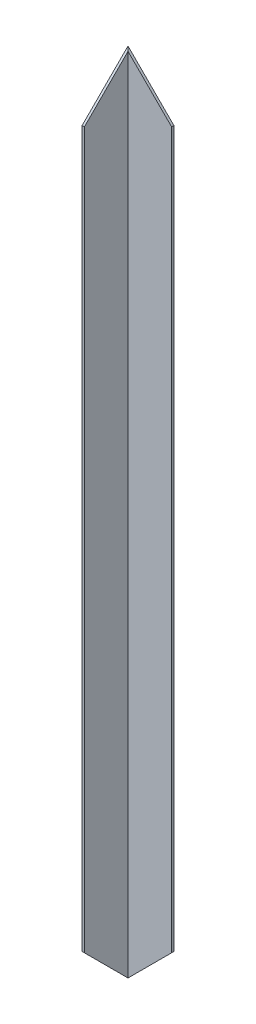
ISO-10303-21;
HEADER;
FILE_DESCRIPTION(('STEP AP214'),'2;1');
FILE_NAME('part.step','',(''),(''),'','','');
FILE_SCHEMA(('AUTOMOTIVE_DESIGN { 1 0 10303 214 1 1 1 1 }'));
ENDSEC;
DATA;
#1=APPLICATION_CONTEXT('core data for automotive mechanical design processes');
#2=APPLICATION_PROTOCOL_DEFINITION('international standard','automotive_design',2000,#1);
#3=PRODUCT_CONTEXT('',#1,'mechanical');
#4=PRODUCT('Part','Part','',(#3));
#5=PRODUCT_RELATED_PRODUCT_CATEGORY('part','',(#4));
#6=PRODUCT_DEFINITION_FORMATION('','',#4);
#7=PRODUCT_DEFINITION_CONTEXT('part definition',#1,'design');
#8=PRODUCT_DEFINITION('design','',#6,#7);
#9=PRODUCT_DEFINITION_SHAPE('','',#8);
#10=(LENGTH_UNIT() NAMED_UNIT(*) SI_UNIT(.MILLI.,.METRE.));
#11=(NAMED_UNIT(*) PLANE_ANGLE_UNIT() SI_UNIT($,.RADIAN.));
#12=(NAMED_UNIT(*) SI_UNIT($,.STERADIAN.) SOLID_ANGLE_UNIT());
#13=UNCERTAINTY_MEASURE_WITH_UNIT(LENGTH_MEASURE(1.E-05),#10,'distance_accuracy_value','');
#14=(GEOMETRIC_REPRESENTATION_CONTEXT(3) GLOBAL_UNCERTAINTY_ASSIGNED_CONTEXT((#13)) GLOBAL_UNIT_ASSIGNED_CONTEXT((#10,
#11,#12)) REPRESENTATION_CONTEXT('',''));
#15=CARTESIAN_POINT('',(0.,0.,0.));
#16=DIRECTION('',(0.,0.,1.));
#17=DIRECTION('',(1.,0.,0.));
#18=AXIS2_PLACEMENT_3D('',#15,#16,#17);
#19=CARTESIAN_POINT('',(-20.,704.,-20.1136363636364));
#20=DIRECTION('',(1.,0.,0.));
#21=DIRECTION('',(0.,0.,-1.));
#22=AXIS2_PLACEMENT_3D('',#19,#20,#21);
#23=PLANE('',#22);
#24=DIRECTION('',(0.,-1.,0.));
#25=VECTOR('',#24,1.);
#26=CARTESIAN_POINT('',(-20.,704.,19.8863636363636));
#27=LINE('',#26,#25);
#28=CARTESIAN_POINT('',(-20.,664.,19.8863636363636));
#29=VERTEX_POINT('',#28);
#30=CARTESIAN_POINT('',(-20.,39.9999999999996,19.8863636363636));
#31=VERTEX_POINT('',#30);
#32=EDGE_CURVE('E110',#29,#31,#27,.T.);
#33=ORIENTED_EDGE('',*,*,#32,.F.);
#34=DIRECTION('',(0.,-0.707106781186544,0.707106781186551));
#35=VECTOR('',#34,1.);
#36=CARTESIAN_POINT('',(-20.,704.,-20.1136363636364));
#37=LINE('',#36,#35);
#38=CARTESIAN_POINT('',(-20.,704.,-20.1136363636364));
#39=VERTEX_POINT('',#38);
#40=EDGE_CURVE('E128',#39,#29,#37,.T.);
#41=ORIENTED_EDGE('',*,*,#40,.F.);
#42=DIRECTION('',(0.,-1.,0.));
#43=VECTOR('',#42,1.);
#44=CARTESIAN_POINT('',(-20.,704.,-20.1136363636364));
#45=LINE('',#44,#43);
#46=CARTESIAN_POINT('',(-20.,0.,-20.1136363636364));
#47=VERTEX_POINT('',#46);
#48=EDGE_CURVE('E96',#39,#47,#45,.T.);
#49=ORIENTED_EDGE('',*,*,#48,.T.);
#50=DIRECTION('',(0.,-0.707106781186544,-0.707106781186551));
#51=VECTOR('',#50,1.);
#52=CARTESIAN_POINT('',(-20.,0.,-20.1136363636364));
#53=LINE('',#52,#51);
#54=EDGE_CURVE('E127',#31,#47,#53,.T.);
#55=ORIENTED_EDGE('',*,*,#54,.F.);
#56=EDGE_LOOP('',(#33,#41,#49,#55));
#57=FACE_BOUND('',#56,.T.);
#58=ADVANCED_FACE('F33',(#57),#23,.F.);
#59=CARTESIAN_POINT('',(-20.,704.,19.8863636363636));
#60=DIRECTION('',(0.,0.,-1.));
#61=DIRECTION('',(-1.,0.,0.));
#62=AXIS2_PLACEMENT_3D('',#59,#60,#61);
#63=PLANE('',#62);
#64=DIRECTION('',(0.,-1.,0.));
#65=VECTOR('',#64,1.);
#66=CARTESIAN_POINT('',(-18.,704.,19.8863636363636));
#67=LINE('',#66,#65);
#68=CARTESIAN_POINT('',(-18.,664.,19.8863636363636));
#69=VERTEX_POINT('',#68);
#70=CARTESIAN_POINT('',(-18.,39.9999999999996,19.8863636363636));
#71=VERTEX_POINT('',#70);
#72=EDGE_CURVE('E108',#69,#71,#67,.T.);
#73=ORIENTED_EDGE('',*,*,#72,.F.);
#74=DIRECTION('',(-1.,0.,0.));
#75=VECTOR('',#74,1.);
#76=CARTESIAN_POINT('',(20.,664.,19.8863636363636));
#77=LINE('',#76,#75);
#78=EDGE_CURVE('E131',#69,#29,#77,.T.);
#79=ORIENTED_EDGE('',*,*,#78,.T.);
#80=ORIENTED_EDGE('',*,*,#32,.T.);
#81=DIRECTION('',(-1.,0.,0.));
#82=VECTOR('',#81,1.);
#83=CARTESIAN_POINT('',(570.,39.9999999999996,19.8863636363635));
#84=LINE('',#83,#82);
#85=EDGE_CURVE('E140',#71,#31,#84,.T.);
#86=ORIENTED_EDGE('',*,*,#85,.F.);
#87=EDGE_LOOP('',(#73,#79,#80,#86));
#88=FACE_BOUND('',#87,.T.);
#89=ADVANCED_FACE('F154',(#88),#63,.F.);
#90=CARTESIAN_POINT('',(-18.,704.,-18.1136363636364));
#91=DIRECTION('',(-1.,0.,0.));
#92=DIRECTION('',(0.,0.,1.));
#93=AXIS2_PLACEMENT_3D('',#90,#91,#92);
#94=PLANE('',#93);
#95=DIRECTION('',(0.,-1.,0.));
#96=VECTOR('',#95,1.);
#97=CARTESIAN_POINT('',(-18.,704.,-18.1136363636364));
#98=LINE('',#97,#96);
#99=CARTESIAN_POINT('',(-18.,702.,-18.1136363636364));
#100=VERTEX_POINT('',#99);
#101=CARTESIAN_POINT('',(-18.,2.,-18.1136363636364));
#102=VERTEX_POINT('',#101);
#103=EDGE_CURVE('E101',#100,#102,#98,.T.);
#104=ORIENTED_EDGE('',*,*,#103,.F.);
#105=DIRECTION('',(0.,-0.707106781186544,0.707106781186551));
#106=VECTOR('',#105,1.);
#107=CARTESIAN_POINT('',(-18.,703.,-19.1136363636363));
#108=LINE('',#107,#106);
#109=EDGE_CURVE('E133',#100,#69,#108,.T.);
#110=ORIENTED_EDGE('',*,*,#109,.T.);
#111=ORIENTED_EDGE('',*,*,#72,.T.);
#112=DIRECTION('',(0.,-0.707106781186544,-0.707106781186551));
#113=VECTOR('',#112,1.);
#114=CARTESIAN_POINT('',(-18.,352.999999999996,332.886363636364));
#115=LINE('',#114,#113);
#116=EDGE_CURVE('E121',#71,#102,#115,.T.);
#117=ORIENTED_EDGE('',*,*,#116,.T.);
#118=EDGE_LOOP('',(#104,#110,#111,#117));
#119=FACE_BOUND('',#118,.T.);
#120=ADVANCED_FACE('F149',(#119),#94,.F.);
#121=CARTESIAN_POINT('',(-18.,704.,-18.1136363636364));
#122=DIRECTION('',(0.,0.,-1.));
#123=DIRECTION('',(-1.,0.,0.));
#124=AXIS2_PLACEMENT_3D('',#121,#122,#123);
#125=PLANE('',#124);
#126=DIRECTION('',(0.,-1.,0.));
#127=VECTOR('',#126,1.);
#128=CARTESIAN_POINT('',(20.,704.,-18.1136363636364));
#129=LINE('',#128,#127);
#130=CARTESIAN_POINT('',(20.,664.,-18.1136363636364));
#131=VERTEX_POINT('',#130);
#132=CARTESIAN_POINT('',(20.,40.0000000000001,-18.1136363636364));
#133=VERTEX_POINT('',#132);
#134=EDGE_CURVE('E47',#131,#133,#129,.T.);
#135=ORIENTED_EDGE('',*,*,#134,.F.);
#136=DIRECTION('',(-0.707106781186551,0.707106781186544,0.));
#137=VECTOR('',#136,1.);
#138=CARTESIAN_POINT('',(-19.,703.,-18.1136363636364));
#139=LINE('',#138,#137);
#140=EDGE_CURVE('E91',#131,#100,#139,.T.);
#141=ORIENTED_EDGE('',*,*,#140,.T.);
#142=ORIENTED_EDGE('',*,*,#103,.T.);
#143=DIRECTION('',(0.707106781186547,0.707106781186549,0.));
#144=VECTOR('',#143,1.);
#145=CARTESIAN_POINT('',(333.,353.000000000001,-18.1136363636364));
#146=LINE('',#145,#144);
#147=EDGE_CURVE('E103',#102,#133,#146,.T.);
#148=ORIENTED_EDGE('',*,*,#147,.T.);
#149=EDGE_LOOP('',(#135,#141,#142,#148));
#150=FACE_BOUND('',#149,.T.);
#151=ADVANCED_FACE('F145',(#150),#125,.F.);
#152=CARTESIAN_POINT('',(20.,704.,-20.1136363636364));
#153=DIRECTION('',(-1.,0.,0.));
#154=DIRECTION('',(0.,0.,1.));
#155=AXIS2_PLACEMENT_3D('',#152,#153,#154);
#156=PLANE('',#155);
#157=DIRECTION('',(0.,-1.,0.));
#158=VECTOR('',#157,1.);
#159=CARTESIAN_POINT('',(20.,704.,-20.1136363636364));
#160=LINE('',#159,#158);
#161=CARTESIAN_POINT('',(20.,664.,-20.1136363636364));
#162=VERTEX_POINT('',#161);
#163=CARTESIAN_POINT('',(20.,40.0000000000001,-20.1136363636364));
#164=VERTEX_POINT('',#163);
#165=EDGE_CURVE('E55',#162,#164,#160,.T.);
#166=ORIENTED_EDGE('',*,*,#165,.F.);
#167=DIRECTION('',(0.,0.,-1.));
#168=VECTOR('',#167,1.);
#169=CARTESIAN_POINT('',(20.,664.,19.8863636363636));
#170=LINE('',#169,#168);
#171=EDGE_CURVE('E87',#131,#162,#170,.T.);
#172=ORIENTED_EDGE('',*,*,#171,.F.);
#173=ORIENTED_EDGE('',*,*,#134,.T.);
#174=DIRECTION('',(0.,0.,-1.));
#175=VECTOR('',#174,1.);
#176=CARTESIAN_POINT('',(20.,40.0000000000001,569.886363636364));
#177=LINE('',#176,#175);
#178=EDGE_CURVE('E99',#133,#164,#177,.T.);
#179=ORIENTED_EDGE('',*,*,#178,.T.);
#180=EDGE_LOOP('',(#166,#172,#173,#179));
#181=FACE_BOUND('',#180,.T.);
#182=ADVANCED_FACE('F98',(#181),#156,.F.);
#183=CARTESIAN_POINT('',(-20.,704.,-20.1136363636364));
#184=DIRECTION('',(0.,0.,1.));
#185=DIRECTION('',(1.,0.,0.));
#186=AXIS2_PLACEMENT_3D('',#183,#184,#185);
#187=PLANE('',#186);
#188=ORIENTED_EDGE('',*,*,#48,.F.);
#189=DIRECTION('',(-0.707106781186551,0.707106781186544,0.));
#190=VECTOR('',#189,1.);
#191=CARTESIAN_POINT('',(-20.,704.,-20.1136363636364));
#192=LINE('',#191,#190);
#193=EDGE_CURVE('E89',#162,#39,#192,.T.);
#194=ORIENTED_EDGE('',*,*,#193,.F.);
#195=ORIENTED_EDGE('',*,*,#165,.T.);
#196=DIRECTION('',(0.707106781186546,0.707106781186548,0.));
#197=VECTOR('',#196,1.);
#198=CARTESIAN_POINT('',(-20.,0.,-20.1136363636364));
#199=LINE('',#198,#197);
#200=EDGE_CURVE('E116',#47,#164,#199,.T.);
#201=ORIENTED_EDGE('',*,*,#200,.F.);
#202=EDGE_LOOP('',(#188,#194,#195,#201));
#203=FACE_BOUND('',#202,.T.);
#204=ADVANCED_FACE('F94',(#203),#187,.F.);
#205=CARTESIAN_POINT('',(-20.,0.,569.886363636364));
#206=DIRECTION('',(-0.707106781186549,0.707106781186547,0.));
#207=DIRECTION('',(-0.707106781186547,-0.707106781186549,0.));
#208=AXIS2_PLACEMENT_3D('',#205,#206,#207);
#209=PLANE('',#208);
#210=ORIENTED_EDGE('',*,*,#147,.F.);
#211=DIRECTION('',(-0.577350269189623,-0.577350269189624,-0.57735026918963));
#212=VECTOR('',#211,1.);
#213=CARTESIAN_POINT('',(176.666666666667,196.666666666668,176.553030303033));
#214=LINE('',#213,#212);
#215=EDGE_CURVE('E40',#102,#47,#214,.T.);
#216=ORIENTED_EDGE('',*,*,#215,.T.);
#217=ORIENTED_EDGE('',*,*,#200,.T.);
#218=ORIENTED_EDGE('',*,*,#178,.F.);
#219=EDGE_LOOP('',(#210,#216,#217,#218));
#220=FACE_BOUND('',#219,.T.);
#221=ADVANCED_FACE('F115',(#220),#209,.F.);
#222=CARTESIAN_POINT('',(570.,0.,-20.1136363636365));
#223=DIRECTION('',(0.,0.707106781186551,-0.707106781186544));
#224=DIRECTION('',(0.,0.707106781186544,0.707106781186551));
#225=AXIS2_PLACEMENT_3D('',#222,#223,#224);
#226=PLANE('',#225);
#227=ORIENTED_EDGE('',*,*,#85,.T.);
#228=ORIENTED_EDGE('',*,*,#54,.T.);
#229=ORIENTED_EDGE('',*,*,#215,.F.);
#230=ORIENTED_EDGE('',*,*,#116,.F.);
#231=EDGE_LOOP('',(#227,#228,#229,#230));
#232=FACE_BOUND('',#231,.T.);
#233=ADVANCED_FACE('F152',(#232),#226,.F.);
#234=CARTESIAN_POINT('',(20.,704.,-20.1136363636364));
#235=DIRECTION('',(0.,-0.707106781186551,-0.707106781186544));
#236=DIRECTION('',(0.,0.707106781186544,-0.707106781186551));
#237=AXIS2_PLACEMENT_3D('',#234,#235,#236);
#238=PLANE('',#237);
#239=ORIENTED_EDGE('',*,*,#109,.F.);
#240=DIRECTION('',(-0.577350269189628,0.577350269189622,-0.577350269189628));
#241=VECTOR('',#240,1.);
#242=CARTESIAN_POINT('',(-6.66666666666658,690.666666666667,-6.78030303030294));
#243=LINE('',#242,#241);
#244=EDGE_CURVE('E11',#100,#39,#243,.T.);
#245=ORIENTED_EDGE('',*,*,#244,.T.);
#246=ORIENTED_EDGE('',*,*,#40,.T.);
#247=ORIENTED_EDGE('',*,*,#78,.F.);
#248=EDGE_LOOP('',(#239,#245,#246,#247));
#249=FACE_BOUND('',#248,.T.);
#250=ADVANCED_FACE('F155',(#249),#238,.F.);
#251=CARTESIAN_POINT('',(-20.,704.,19.8863636363636));
#252=DIRECTION('',(-0.707106781186544,-0.707106781186551,0.));
#253=DIRECTION('',(0.707106781186551,-0.707106781186544,0.));
#254=AXIS2_PLACEMENT_3D('',#251,#252,#253);
#255=PLANE('',#254);
#256=ORIENTED_EDGE('',*,*,#171,.T.);
#257=ORIENTED_EDGE('',*,*,#193,.T.);
#258=ORIENTED_EDGE('',*,*,#244,.F.);
#259=ORIENTED_EDGE('',*,*,#140,.F.);
#260=EDGE_LOOP('',(#256,#257,#258,#259));
#261=FACE_BOUND('',#260,.T.);
#262=ADVANCED_FACE('F88',(#261),#255,.F.);
#263=CLOSED_SHELL('',(#58,#89,#120,#151,#182,#204,#221,#233,#250,#262));
#264=MANIFOLD_SOLID_BREP('B2',#263);
#265=ADVANCED_BREP_SHAPE_REPRESENTATION('',(#18,#264),#14);
#266=SHAPE_DEFINITION_REPRESENTATION(#9,#265);
ENDSEC;
END-ISO-10303-21;
